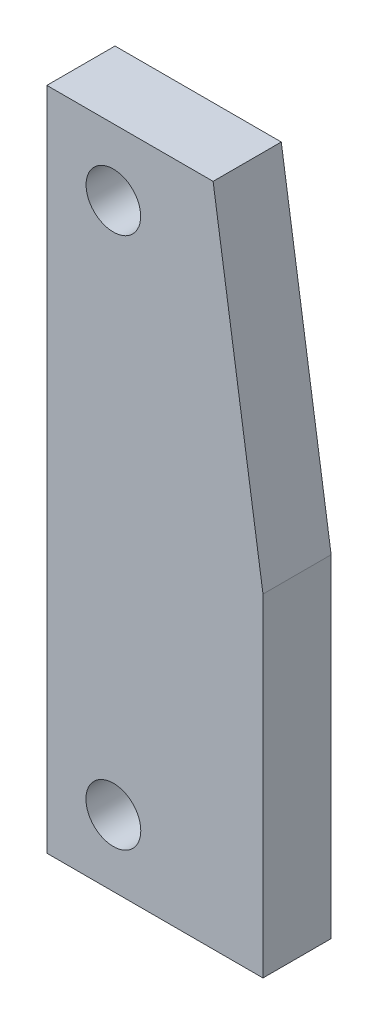
ISO-10303-21;
HEADER;
FILE_DESCRIPTION(('STEP AP214'),'2;1');
FILE_NAME('part.step','',(''),(''),'','','');
FILE_SCHEMA(('AUTOMOTIVE_DESIGN { 1 0 10303 214 1 1 1 1 }'));
ENDSEC;
DATA;
#1=APPLICATION_CONTEXT('core data for automotive mechanical design processes');
#2=APPLICATION_PROTOCOL_DEFINITION('international standard','automotive_design',2000,#1);
#3=PRODUCT_CONTEXT('',#1,'mechanical');
#4=PRODUCT('Part','Part','',(#3));
#5=PRODUCT_RELATED_PRODUCT_CATEGORY('part','',(#4));
#6=PRODUCT_DEFINITION_FORMATION('','',#4);
#7=PRODUCT_DEFINITION_CONTEXT('part definition',#1,'design');
#8=PRODUCT_DEFINITION('design','',#6,#7);
#9=PRODUCT_DEFINITION_SHAPE('','',#8);
#10=(LENGTH_UNIT() NAMED_UNIT(*) SI_UNIT(.MILLI.,.METRE.));
#11=(NAMED_UNIT(*) PLANE_ANGLE_UNIT() SI_UNIT($,.RADIAN.));
#12=(NAMED_UNIT(*) SI_UNIT($,.STERADIAN.) SOLID_ANGLE_UNIT());
#13=UNCERTAINTY_MEASURE_WITH_UNIT(LENGTH_MEASURE(1.E-05),#10,'distance_accuracy_value','');
#14=(GEOMETRIC_REPRESENTATION_CONTEXT(3) GLOBAL_UNCERTAINTY_ASSIGNED_CONTEXT((#13)) GLOBAL_UNIT_ASSIGNED_CONTEXT((#10,
#11,#12)) REPRESENTATION_CONTEXT('',''));
#15=CARTESIAN_POINT('',(0.,0.,0.));
#16=DIRECTION('',(0.,0.,1.));
#17=DIRECTION('',(1.,0.,0.));
#18=AXIS2_PLACEMENT_3D('',#15,#16,#17);
#19=CARTESIAN_POINT('',(0.,0.,4.1));
#20=DIRECTION('',(0.,0.,-1.));
#21=DIRECTION('',(-1.,0.,0.));
#22=AXIS2_PLACEMENT_3D('',#19,#20,#21);
#23=PLANE('',#22);
#24=DIRECTION('',(1.,0.,0.));
#25=VECTOR('',#24,1.);
#26=CARTESIAN_POINT('',(14.0000000000003,2.48373286099319,4.1));
#27=LINE('',#26,#25);
#28=CARTESIAN_POINT('',(1.00000000000029,2.48373286099319,4.1));
#29=VERTEX_POINT('',#28);
#30=CARTESIAN_POINT('',(14.0000000000003,2.48373286099319,4.1));
#31=VERTEX_POINT('',#30);
#32=EDGE_CURVE('E117',#29,#31,#27,.T.);
#33=ORIENTED_EDGE('',*,*,#32,.T.);
#34=DIRECTION('',(0.,1.,0.));
#35=VECTOR('',#34,1.);
#36=CARTESIAN_POINT('',(14.0000000000003,22.4837328609932,4.1));
#37=LINE('',#36,#35);
#38=CARTESIAN_POINT('',(14.0000000000003,22.4837328609932,4.1));
#39=VERTEX_POINT('',#38);
#40=EDGE_CURVE('E84',#31,#39,#37,.T.);
#41=ORIENTED_EDGE('',*,*,#40,.T.);
#42=DIRECTION('',(-0.148340452930244,0.988936352868298,0.));
#43=VECTOR('',#42,1.);
#44=CARTESIAN_POINT('',(11.0000000000003,42.4837328609932,4.1));
#45=LINE('',#44,#43);
#46=CARTESIAN_POINT('',(11.0000000000003,42.4837328609932,4.1));
#47=VERTEX_POINT('',#46);
#48=EDGE_CURVE('E88',#39,#47,#45,.T.);
#49=ORIENTED_EDGE('',*,*,#48,.T.);
#50=DIRECTION('',(-1.,0.,0.));
#51=VECTOR('',#50,1.);
#52=CARTESIAN_POINT('',(1.00000000000029,42.4837328609932,4.1));
#53=LINE('',#52,#51);
#54=CARTESIAN_POINT('',(1.00000000000029,42.4837328609932,4.1));
#55=VERTEX_POINT('',#54);
#56=EDGE_CURVE('E92',#47,#55,#53,.T.);
#57=ORIENTED_EDGE('',*,*,#56,.T.);
#58=DIRECTION('',(0.,-1.,0.));
#59=VECTOR('',#58,1.);
#60=CARTESIAN_POINT('',(1.00000000000029,2.48373286099319,4.1));
#61=LINE('',#60,#59);
#62=EDGE_CURVE('E50',#55,#29,#61,.T.);
#63=ORIENTED_EDGE('',*,*,#62,.T.);
#64=EDGE_LOOP('',(#33,#41,#49,#57,#63));
#65=FACE_BOUND('',#64,.T.);
#66=CARTESIAN_POINT('',(5.00000000000037,6.48373286099319,4.1));
#67=DIRECTION('',(0.,0.,1.));
#68=DIRECTION('',(1.,0.,0.));
#69=AXIS2_PLACEMENT_3D('',#66,#67,#68);
#70=CIRCLE('',#69,1.64999999999994);
#71=CARTESIAN_POINT('',(6.65000000000031,6.48373286099319,4.1));
#72=VERTEX_POINT('',#71);
#73=EDGE_CURVE('E112',#72,#72,#70,.T.);
#74=ORIENTED_EDGE('',*,*,#73,.F.);
#75=EDGE_LOOP('',(#74));
#76=FACE_BOUND('',#75,.T.);
#77=CARTESIAN_POINT('',(5.00000000000034,38.4837328609932,4.1));
#78=DIRECTION('',(0.,0.,1.));
#79=DIRECTION('',(1.,0.,0.));
#80=AXIS2_PLACEMENT_3D('',#77,#78,#79);
#81=CIRCLE('',#80,1.64253279518301);
#82=CARTESIAN_POINT('',(6.64253279518334,38.4837328609932,4.1));
#83=VERTEX_POINT('',#82);
#84=EDGE_CURVE('E153',#83,#83,#81,.T.);
#85=ORIENTED_EDGE('',*,*,#84,.F.);
#86=EDGE_LOOP('',(#85));
#87=FACE_BOUND('',#86,.T.);
#88=ADVANCED_FACE('F33',(#65,#76,#87),#23,.F.);
#89=CARTESIAN_POINT('',(0.,0.,0.));
#90=DIRECTION('',(0.,0.,-1.));
#91=DIRECTION('',(-1.,0.,0.));
#92=AXIS2_PLACEMENT_3D('',#89,#90,#91);
#93=PLANE('',#92);
#94=CARTESIAN_POINT('',(5.00000000000037,6.48373286099319,0.));
#95=DIRECTION('',(0.,0.,1.));
#96=DIRECTION('',(1.,0.,0.));
#97=AXIS2_PLACEMENT_3D('',#94,#95,#96);
#98=CIRCLE('',#97,1.64999999999994);
#99=CARTESIAN_POINT('',(6.65000000000031,6.48373286099319,0.));
#100=VERTEX_POINT('',#99);
#101=EDGE_CURVE('E158',#100,#100,#98,.T.);
#102=ORIENTED_EDGE('',*,*,#101,.T.);
#103=EDGE_LOOP('',(#102));
#104=FACE_BOUND('',#103,.T.);
#105=DIRECTION('',(1.,0.,0.));
#106=VECTOR('',#105,1.);
#107=CARTESIAN_POINT('',(14.0000000000003,2.48373286099319,0.));
#108=LINE('',#107,#106);
#109=CARTESIAN_POINT('',(1.00000000000029,2.48373286099319,0.));
#110=VERTEX_POINT('',#109);
#111=CARTESIAN_POINT('',(14.0000000000003,2.48373286099319,0.));
#112=VERTEX_POINT('',#111);
#113=EDGE_CURVE('E108',#110,#112,#108,.T.);
#114=ORIENTED_EDGE('',*,*,#113,.F.);
#115=DIRECTION('',(0.,-1.,0.));
#116=VECTOR('',#115,1.);
#117=CARTESIAN_POINT('',(1.00000000000029,2.48373286099319,0.));
#118=LINE('',#117,#116);
#119=CARTESIAN_POINT('',(1.00000000000029,42.4837328609932,0.));
#120=VERTEX_POINT('',#119);
#121=EDGE_CURVE('E76',#120,#110,#118,.T.);
#122=ORIENTED_EDGE('',*,*,#121,.F.);
#123=DIRECTION('',(-1.,0.,0.));
#124=VECTOR('',#123,1.);
#125=CARTESIAN_POINT('',(1.00000000000029,42.4837328609932,0.));
#126=LINE('',#125,#124);
#127=CARTESIAN_POINT('',(11.0000000000003,42.4837328609932,0.));
#128=VERTEX_POINT('',#127);
#129=EDGE_CURVE('E70',#128,#120,#126,.T.);
#130=ORIENTED_EDGE('',*,*,#129,.F.);
#131=DIRECTION('',(-0.148340452930244,0.988936352868298,0.));
#132=VECTOR('',#131,1.);
#133=CARTESIAN_POINT('',(11.0000000000003,42.4837328609932,0.));
#134=LINE('',#133,#132);
#135=CARTESIAN_POINT('',(14.0000000000003,22.4837328609932,0.));
#136=VERTEX_POINT('',#135);
#137=EDGE_CURVE('E99',#136,#128,#134,.T.);
#138=ORIENTED_EDGE('',*,*,#137,.F.);
#139=DIRECTION('',(0.,1.,0.));
#140=VECTOR('',#139,1.);
#141=CARTESIAN_POINT('',(14.0000000000003,22.4837328609932,0.));
#142=LINE('',#141,#140);
#143=EDGE_CURVE('E111',#112,#136,#142,.T.);
#144=ORIENTED_EDGE('',*,*,#143,.F.);
#145=EDGE_LOOP('',(#114,#122,#130,#138,#144));
#146=FACE_BOUND('',#145,.T.);
#147=CARTESIAN_POINT('',(5.00000000000034,38.4837328609932,0.));
#148=DIRECTION('',(0.,0.,1.));
#149=DIRECTION('',(1.,0.,0.));
#150=AXIS2_PLACEMENT_3D('',#147,#148,#149);
#151=CIRCLE('',#150,1.64253279518301);
#152=CARTESIAN_POINT('',(6.64253279518334,38.4837328609932,0.));
#153=VERTEX_POINT('',#152);
#154=EDGE_CURVE('E156',#153,#153,#151,.T.);
#155=ORIENTED_EDGE('',*,*,#154,.T.);
#156=EDGE_LOOP('',(#155));
#157=FACE_BOUND('',#156,.T.);
#158=ADVANCED_FACE('F121',(#104,#146,#157),#93,.T.);
#159=CARTESIAN_POINT('',(14.0000000000003,2.48373286099319,4.1));
#160=DIRECTION('',(0.,1.,0.));
#161=DIRECTION('',(0.,0.,1.));
#162=AXIS2_PLACEMENT_3D('',#159,#160,#161);
#163=PLANE('',#162);
#164=ORIENTED_EDGE('',*,*,#113,.T.);
#165=DIRECTION('',(0.,0.,-1.));
#166=VECTOR('',#165,1.);
#167=CARTESIAN_POINT('',(14.0000000000003,2.48373286099319,4.1));
#168=LINE('',#167,#166);
#169=EDGE_CURVE('E11',#31,#112,#168,.T.);
#170=ORIENTED_EDGE('',*,*,#169,.F.);
#171=ORIENTED_EDGE('',*,*,#32,.F.);
#172=DIRECTION('',(0.,0.,-1.));
#173=VECTOR('',#172,1.);
#174=CARTESIAN_POINT('',(1.00000000000029,2.48373286099319,4.1));
#175=LINE('',#174,#173);
#176=EDGE_CURVE('E104',#29,#110,#175,.T.);
#177=ORIENTED_EDGE('',*,*,#176,.T.);
#178=EDGE_LOOP('',(#164,#170,#171,#177));
#179=FACE_BOUND('',#178,.T.);
#180=ADVANCED_FACE('F35',(#179),#163,.F.);
#181=CARTESIAN_POINT('',(14.0000000000003,22.4837328609932,4.1));
#182=DIRECTION('',(-1.,0.,0.));
#183=DIRECTION('',(0.,-1.,0.));
#184=AXIS2_PLACEMENT_3D('',#181,#182,#183);
#185=PLANE('',#184);
#186=ORIENTED_EDGE('',*,*,#143,.T.);
#187=DIRECTION('',(0.,0.,-1.));
#188=VECTOR('',#187,1.);
#189=CARTESIAN_POINT('',(14.0000000000003,22.4837328609932,4.1));
#190=LINE('',#189,#188);
#191=EDGE_CURVE('E42',#39,#136,#190,.T.);
#192=ORIENTED_EDGE('',*,*,#191,.F.);
#193=ORIENTED_EDGE('',*,*,#40,.F.);
#194=ORIENTED_EDGE('',*,*,#169,.T.);
#195=EDGE_LOOP('',(#186,#192,#193,#194));
#196=FACE_BOUND('',#195,.T.);
#197=ADVANCED_FACE('F192',(#196),#185,.F.);
#198=CARTESIAN_POINT('',(11.0000000000003,42.4837328609932,4.1));
#199=DIRECTION('',(-0.988936352868298,-0.148340452930244,0.));
#200=DIRECTION('',(0.148340452930244,-0.988936352868298,0.));
#201=AXIS2_PLACEMENT_3D('',#198,#199,#200);
#202=PLANE('',#201);
#203=ORIENTED_EDGE('',*,*,#137,.T.);
#204=DIRECTION('',(0.,0.,-1.));
#205=VECTOR('',#204,1.);
#206=CARTESIAN_POINT('',(11.0000000000003,42.4837328609932,4.1));
#207=LINE('',#206,#205);
#208=EDGE_CURVE('E96',#47,#128,#207,.T.);
#209=ORIENTED_EDGE('',*,*,#208,.F.);
#210=ORIENTED_EDGE('',*,*,#48,.F.);
#211=ORIENTED_EDGE('',*,*,#191,.T.);
#212=EDGE_LOOP('',(#203,#209,#210,#211));
#213=FACE_BOUND('',#212,.T.);
#214=ADVANCED_FACE('F97',(#213),#202,.F.);
#215=CARTESIAN_POINT('',(1.00000000000029,42.4837328609932,4.1));
#216=DIRECTION('',(0.,-1.,0.));
#217=DIRECTION('',(0.,0.,-1.));
#218=AXIS2_PLACEMENT_3D('',#215,#216,#217);
#219=PLANE('',#218);
#220=ORIENTED_EDGE('',*,*,#129,.T.);
#221=DIRECTION('',(0.,0.,-1.));
#222=VECTOR('',#221,1.);
#223=CARTESIAN_POINT('',(1.00000000000029,42.4837328609932,4.1));
#224=LINE('',#223,#222);
#225=EDGE_CURVE('E100',#55,#120,#224,.T.);
#226=ORIENTED_EDGE('',*,*,#225,.F.);
#227=ORIENTED_EDGE('',*,*,#56,.F.);
#228=ORIENTED_EDGE('',*,*,#208,.T.);
#229=EDGE_LOOP('',(#220,#226,#227,#228));
#230=FACE_BOUND('',#229,.T.);
#231=ADVANCED_FACE('F102',(#230),#219,.F.);
#232=CARTESIAN_POINT('',(1.00000000000029,2.48373286099319,4.1));
#233=DIRECTION('',(1.,0.,0.));
#234=DIRECTION('',(0.,0.,-1.));
#235=AXIS2_PLACEMENT_3D('',#232,#233,#234);
#236=PLANE('',#235);
#237=ORIENTED_EDGE('',*,*,#121,.T.);
#238=ORIENTED_EDGE('',*,*,#176,.F.);
#239=ORIENTED_EDGE('',*,*,#62,.F.);
#240=ORIENTED_EDGE('',*,*,#225,.T.);
#241=EDGE_LOOP('',(#237,#238,#239,#240));
#242=FACE_BOUND('',#241,.T.);
#243=ADVANCED_FACE('F126',(#242),#236,.F.);
#244=CARTESIAN_POINT('',(5.00000000000037,6.48373286099319,4.1));
#245=DIRECTION('',(0.,0.,-1.));
#246=DIRECTION('',(-1.,0.,0.));
#247=AXIS2_PLACEMENT_3D('',#244,#245,#246);
#248=CYLINDRICAL_SURFACE('',#247,1.64999999999994);
#249=ORIENTED_EDGE('',*,*,#73,.T.);
#250=EDGE_LOOP('',(#249));
#251=FACE_BOUND('',#250,.T.);
#252=ORIENTED_EDGE('',*,*,#101,.F.);
#253=EDGE_LOOP('',(#252));
#254=FACE_BOUND('',#253,.T.);
#255=ADVANCED_FACE('F128',(#251,#254),#248,.F.);
#256=CARTESIAN_POINT('',(5.00000000000034,38.4837328609932,4.1));
#257=DIRECTION('',(0.,0.,-1.));
#258=DIRECTION('',(-1.,0.,0.));
#259=AXIS2_PLACEMENT_3D('',#256,#257,#258);
#260=CYLINDRICAL_SURFACE('',#259,1.64253279518301);
#261=ORIENTED_EDGE('',*,*,#84,.T.);
#262=EDGE_LOOP('',(#261));
#263=FACE_BOUND('',#262,.T.);
#264=ORIENTED_EDGE('',*,*,#154,.F.);
#265=EDGE_LOOP('',(#264));
#266=FACE_BOUND('',#265,.T.);
#267=ADVANCED_FACE('F134',(#263,#266),#260,.F.);
#268=CLOSED_SHELL('',(#88,#158,#180,#197,#214,#231,#243,#255,#267));
#269=MANIFOLD_SOLID_BREP('B2',#268);
#270=ADVANCED_BREP_SHAPE_REPRESENTATION('',(#18,#269),#14);
#271=SHAPE_DEFINITION_REPRESENTATION(#9,#270);
ENDSEC;
END-ISO-10303-21;
